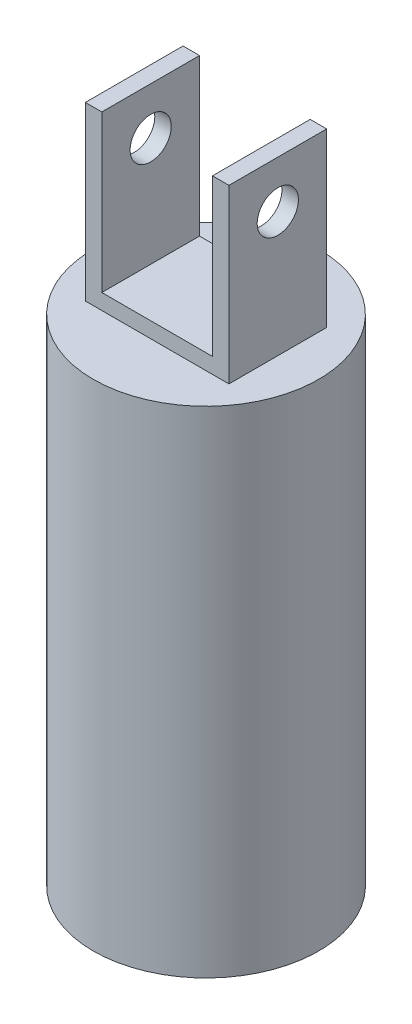
ISO-10303-21;
HEADER;
FILE_DESCRIPTION(('STEP AP214'),'2;1');
FILE_NAME('part.step','',(''),(''),'','','');
FILE_SCHEMA(('AUTOMOTIVE_DESIGN { 1 0 10303 214 1 1 1 1 }'));
ENDSEC;
DATA;
#1=APPLICATION_CONTEXT('core data for automotive mechanical design processes');
#2=APPLICATION_PROTOCOL_DEFINITION('international standard','automotive_design',2000,#1);
#3=PRODUCT_CONTEXT('',#1,'mechanical');
#4=PRODUCT('Part','Part','',(#3));
#5=PRODUCT_RELATED_PRODUCT_CATEGORY('part','',(#4));
#6=PRODUCT_DEFINITION_FORMATION('','',#4);
#7=PRODUCT_DEFINITION_CONTEXT('part definition',#1,'design');
#8=PRODUCT_DEFINITION('design','',#6,#7);
#9=PRODUCT_DEFINITION_SHAPE('','',#8);
#10=(LENGTH_UNIT() NAMED_UNIT(*) SI_UNIT(.MILLI.,.METRE.));
#11=(NAMED_UNIT(*) PLANE_ANGLE_UNIT() SI_UNIT($,.RADIAN.));
#12=(NAMED_UNIT(*) SI_UNIT($,.STERADIAN.) SOLID_ANGLE_UNIT());
#13=UNCERTAINTY_MEASURE_WITH_UNIT(LENGTH_MEASURE(1.E-05),#10,'distance_accuracy_value','');
#14=(GEOMETRIC_REPRESENTATION_CONTEXT(3) GLOBAL_UNCERTAINTY_ASSIGNED_CONTEXT((#13)) GLOBAL_UNIT_ASSIGNED_CONTEXT((#10,
#11,#12)) REPRESENTATION_CONTEXT('',''));
#15=CARTESIAN_POINT('',(0.,0.,0.));
#16=DIRECTION('',(0.,0.,1.));
#17=DIRECTION('',(1.,0.,0.));
#18=AXIS2_PLACEMENT_3D('',#15,#16,#17);
#19=CARTESIAN_POINT('',(0.,50.3809,28.6258));
#20=DIRECTION('',(0.,1.,0.));
#21=DIRECTION('',(0.,0.,1.));
#22=AXIS2_PLACEMENT_3D('',#19,#20,#21);
#23=PLANE('',#22);
#24=DIRECTION('',(1.,0.,0.));
#25=VECTOR('',#24,1.);
#26=CARTESIAN_POINT('',(0.,50.3809,0.));
#27=LINE('',#26,#25);
#28=CARTESIAN_POINT('',(37.2364,50.3809,0.));
#29=VERTEX_POINT('',#28);
#30=CARTESIAN_POINT('',(42.0624,50.3809,0.));
#31=VERTEX_POINT('',#30);
#32=EDGE_CURVE('E137',#29,#31,#27,.T.);
#33=ORIENTED_EDGE('',*,*,#32,.F.);
#34=DIRECTION('',(0.,0.,-1.));
#35=VECTOR('',#34,1.);
#36=CARTESIAN_POINT('',(37.2364,50.3809,28.6258));
#37=LINE('',#36,#35);
#38=CARTESIAN_POINT('',(37.2364,50.3809,28.6258));
#39=VERTEX_POINT('',#38);
#40=EDGE_CURVE('E12',#39,#29,#37,.T.);
#41=ORIENTED_EDGE('',*,*,#40,.F.);
#42=DIRECTION('',(1.,0.,0.));
#43=VECTOR('',#42,1.);
#44=CARTESIAN_POINT('',(0.,50.3809,28.6258));
#45=LINE('',#44,#43);
#46=CARTESIAN_POINT('',(42.0624,50.3809,28.6258));
#47=VERTEX_POINT('',#46);
#48=EDGE_CURVE('E158',#39,#47,#45,.T.);
#49=ORIENTED_EDGE('',*,*,#48,.T.);
#50=DIRECTION('',(0.,0.,-1.));
#51=VECTOR('',#50,1.);
#52=CARTESIAN_POINT('',(42.0624,50.3809,28.6258));
#53=LINE('',#52,#51);
#54=EDGE_CURVE('E94',#47,#31,#53,.T.);
#55=ORIENTED_EDGE('',*,*,#54,.T.);
#56=EDGE_LOOP('',(#33,#41,#49,#55));
#57=FACE_BOUND('',#56,.T.);
#58=ADVANCED_FACE('F44',(#57),#23,.T.);
#59=CARTESIAN_POINT('',(37.2364,0.,28.6258));
#60=DIRECTION('',(-1.,0.,0.));
#61=DIRECTION('',(0.,0.,1.));
#62=AXIS2_PLACEMENT_3D('',#59,#60,#61);
#63=PLANE('',#62);
#64=CARTESIAN_POINT('',(37.2364,36.576,14.3129));
#65=DIRECTION('',(-1.,0.,0.));
#66=DIRECTION('',(0.,0.,1.));
#67=AXIS2_PLACEMENT_3D('',#64,#65,#66);
#68=CIRCLE('',#67,6.0325);
#69=CARTESIAN_POINT('',(37.2364,36.576,20.3454));
#70=VERTEX_POINT('',#69);
#71=EDGE_CURVE('E199',#70,#70,#68,.T.);
#72=ORIENTED_EDGE('',*,*,#71,.F.);
#73=EDGE_LOOP('',(#72));
#74=FACE_BOUND('',#73,.T.);
#75=DIRECTION('',(0.,1.,0.));
#76=VECTOR('',#75,1.);
#77=CARTESIAN_POINT('',(37.2364,0.,0.));
#78=LINE('',#77,#76);
#79=CARTESIAN_POINT('',(37.2364,4.572,0.));
#80=VERTEX_POINT('',#79);
#81=EDGE_CURVE('E140',#80,#29,#78,.T.);
#82=ORIENTED_EDGE('',*,*,#81,.F.);
#83=DIRECTION('',(0.,0.,-1.));
#84=VECTOR('',#83,1.);
#85=CARTESIAN_POINT('',(37.2364,4.572,28.6258));
#86=LINE('',#85,#84);
#87=CARTESIAN_POINT('',(37.2364,4.572,28.6258));
#88=VERTEX_POINT('',#87);
#89=EDGE_CURVE('E52',#88,#80,#86,.T.);
#90=ORIENTED_EDGE('',*,*,#89,.F.);
#91=DIRECTION('',(0.,1.,0.));
#92=VECTOR('',#91,1.);
#93=CARTESIAN_POINT('',(37.2364,0.,28.6258));
#94=LINE('',#93,#92);
#95=EDGE_CURVE('E184',#88,#39,#94,.T.);
#96=ORIENTED_EDGE('',*,*,#95,.T.);
#97=ORIENTED_EDGE('',*,*,#40,.T.);
#98=EDGE_LOOP('',(#82,#90,#96,#97));
#99=FACE_BOUND('',#98,.T.);
#100=ADVANCED_FACE('F175',(#74,#99),#63,.T.);
#101=CARTESIAN_POINT('',(0.,4.572,28.6258));
#102=DIRECTION('',(0.,1.,0.));
#103=DIRECTION('',(0.,0.,1.));
#104=AXIS2_PLACEMENT_3D('',#101,#102,#103);
#105=PLANE('',#104);
#106=DIRECTION('',(1.,0.,0.));
#107=VECTOR('',#106,1.);
#108=CARTESIAN_POINT('',(0.,4.572,0.));
#109=LINE('',#108,#107);
#110=CARTESIAN_POINT('',(4.826,4.572,0.));
#111=VERTEX_POINT('',#110);
#112=EDGE_CURVE('E144',#111,#80,#109,.T.);
#113=ORIENTED_EDGE('',*,*,#112,.F.);
#114=DIRECTION('',(0.,0.,-1.));
#115=VECTOR('',#114,1.);
#116=CARTESIAN_POINT('',(4.826,4.572,28.6258));
#117=LINE('',#116,#115);
#118=CARTESIAN_POINT('',(4.826,4.572,28.6258));
#119=VERTEX_POINT('',#118);
#120=EDGE_CURVE('E164',#119,#111,#117,.T.);
#121=ORIENTED_EDGE('',*,*,#120,.F.);
#122=DIRECTION('',(1.,0.,0.));
#123=VECTOR('',#122,1.);
#124=CARTESIAN_POINT('',(0.,4.572,28.6258));
#125=LINE('',#124,#123);
#126=EDGE_CURVE('E171',#119,#88,#125,.T.);
#127=ORIENTED_EDGE('',*,*,#126,.T.);
#128=ORIENTED_EDGE('',*,*,#89,.T.);
#129=EDGE_LOOP('',(#113,#121,#127,#128));
#130=FACE_BOUND('',#129,.T.);
#131=ADVANCED_FACE('F169',(#130),#105,.T.);
#132=CARTESIAN_POINT('',(4.826,0.,28.6258));
#133=DIRECTION('',(1.,0.,0.));
#134=DIRECTION('',(0.,0.,-1.));
#135=AXIS2_PLACEMENT_3D('',#132,#133,#134);
#136=PLANE('',#135);
#137=CARTESIAN_POINT('',(4.826,36.576,14.3129));
#138=DIRECTION('',(1.,0.,0.));
#139=DIRECTION('',(0.,0.,-1.));
#140=AXIS2_PLACEMENT_3D('',#137,#138,#139);
#141=CIRCLE('',#140,6.0325);
#142=CARTESIAN_POINT('',(4.826,36.576,8.2804));
#143=VERTEX_POINT('',#142);
#144=EDGE_CURVE('E202',#143,#143,#141,.T.);
#145=ORIENTED_EDGE('',*,*,#144,.F.);
#146=EDGE_LOOP('',(#145));
#147=FACE_BOUND('',#146,.T.);
#148=DIRECTION('',(0.,-1.,0.));
#149=VECTOR('',#148,1.);
#150=CARTESIAN_POINT('',(4.826,0.,0.));
#151=LINE('',#150,#149);
#152=CARTESIAN_POINT('',(4.826,50.3809,0.));
#153=VERTEX_POINT('',#152);
#154=EDGE_CURVE('E147',#153,#111,#151,.T.);
#155=ORIENTED_EDGE('',*,*,#154,.F.);
#156=DIRECTION('',(0.,0.,-1.));
#157=VECTOR('',#156,1.);
#158=CARTESIAN_POINT('',(4.826,50.3809,28.6258));
#159=LINE('',#158,#157);
#160=CARTESIAN_POINT('',(4.826,50.3809,28.6258));
#161=VERTEX_POINT('',#160);
#162=EDGE_CURVE('E162',#161,#153,#159,.T.);
#163=ORIENTED_EDGE('',*,*,#162,.F.);
#164=DIRECTION('',(0.,-1.,0.));
#165=VECTOR('',#164,1.);
#166=CARTESIAN_POINT('',(4.826,0.,28.6258));
#167=LINE('',#166,#165);
#168=EDGE_CURVE('E183',#161,#119,#167,.T.);
#169=ORIENTED_EDGE('',*,*,#168,.T.);
#170=ORIENTED_EDGE('',*,*,#120,.T.);
#171=EDGE_LOOP('',(#155,#163,#169,#170));
#172=FACE_BOUND('',#171,.T.);
#173=ADVANCED_FACE('F181',(#147,#172),#136,.T.);
#174=CARTESIAN_POINT('',(0.,50.3809,28.6258));
#175=DIRECTION('',(0.,1.,0.));
#176=DIRECTION('',(0.,0.,1.));
#177=AXIS2_PLACEMENT_3D('',#174,#175,#176);
#178=PLANE('',#177);
#179=DIRECTION('',(1.,0.,0.));
#180=VECTOR('',#179,1.);
#181=CARTESIAN_POINT('',(0.,50.3809,0.));
#182=LINE('',#181,#180);
#183=CARTESIAN_POINT('',(0.,50.3809,0.));
#184=VERTEX_POINT('',#183);
#185=EDGE_CURVE('E150',#184,#153,#182,.T.);
#186=ORIENTED_EDGE('',*,*,#185,.F.);
#187=DIRECTION('',(0.,0.,-1.));
#188=VECTOR('',#187,1.);
#189=CARTESIAN_POINT('',(0.,50.3809,28.6258));
#190=LINE('',#189,#188);
#191=CARTESIAN_POINT('',(0.,50.3809,28.6258));
#192=VERTEX_POINT('',#191);
#193=EDGE_CURVE('E122',#192,#184,#190,.T.);
#194=ORIENTED_EDGE('',*,*,#193,.F.);
#195=DIRECTION('',(1.,0.,0.));
#196=VECTOR('',#195,1.);
#197=CARTESIAN_POINT('',(0.,50.3809,28.6258));
#198=LINE('',#197,#196);
#199=EDGE_CURVE('E129',#192,#161,#198,.T.);
#200=ORIENTED_EDGE('',*,*,#199,.T.);
#201=ORIENTED_EDGE('',*,*,#162,.T.);
#202=EDGE_LOOP('',(#186,#194,#200,#201));
#203=FACE_BOUND('',#202,.T.);
#204=ADVANCED_FACE('F190',(#203),#178,.T.);
#205=CARTESIAN_POINT('',(0.,0.,28.6258));
#206=DIRECTION('',(-1.,0.,0.));
#207=DIRECTION('',(0.,0.,1.));
#208=AXIS2_PLACEMENT_3D('',#205,#206,#207);
#209=PLANE('',#208);
#210=CARTESIAN_POINT('',(0.,36.576,14.3129));
#211=DIRECTION('',(-1.,0.,0.));
#212=DIRECTION('',(0.,0.,1.));
#213=AXIS2_PLACEMENT_3D('',#210,#211,#212);
#214=CIRCLE('',#213,6.0325);
#215=CARTESIAN_POINT('',(0.,36.576,20.3454));
#216=VERTEX_POINT('',#215);
#217=EDGE_CURVE('E205',#216,#216,#214,.T.);
#218=ORIENTED_EDGE('',*,*,#217,.F.);
#219=EDGE_LOOP('',(#218));
#220=FACE_BOUND('',#219,.T.);
#221=DIRECTION('',(0.,1.,0.));
#222=VECTOR('',#221,1.);
#223=CARTESIAN_POINT('',(0.,0.,0.));
#224=LINE('',#223,#222);
#225=CARTESIAN_POINT('',(0.,0.,0.));
#226=VERTEX_POINT('',#225);
#227=EDGE_CURVE('E118',#226,#184,#224,.T.);
#228=ORIENTED_EDGE('',*,*,#227,.F.);
#229=DIRECTION('',(0.,0.,-1.));
#230=VECTOR('',#229,1.);
#231=CARTESIAN_POINT('',(0.,0.,28.6258));
#232=LINE('',#231,#230);
#233=CARTESIAN_POINT('',(0.,0.,28.6258));
#234=VERTEX_POINT('',#233);
#235=EDGE_CURVE('E113',#234,#226,#232,.T.);
#236=ORIENTED_EDGE('',*,*,#235,.F.);
#237=DIRECTION('',(0.,1.,0.));
#238=VECTOR('',#237,1.);
#239=CARTESIAN_POINT('',(0.,0.,28.6258));
#240=LINE('',#239,#238);
#241=EDGE_CURVE('E116',#234,#192,#240,.T.);
#242=ORIENTED_EDGE('',*,*,#241,.T.);
#243=ORIENTED_EDGE('',*,*,#193,.T.);
#244=EDGE_LOOP('',(#228,#236,#242,#243));
#245=FACE_BOUND('',#244,.T.);
#246=ADVANCED_FACE('F115',(#220,#245),#209,.T.);
#247=CARTESIAN_POINT('',(42.0624,0.,28.6258));
#248=DIRECTION('',(-1.,0.,0.));
#249=DIRECTION('',(0.,0.,1.));
#250=AXIS2_PLACEMENT_3D('',#247,#248,#249);
#251=PLANE('',#250);
#252=CARTESIAN_POINT('',(42.0624,36.576,14.3129));
#253=DIRECTION('',(1.,0.,0.));
#254=DIRECTION('',(0.,0.,-1.));
#255=AXIS2_PLACEMENT_3D('',#252,#253,#254);
#256=CIRCLE('',#255,6.0325);
#257=CARTESIAN_POINT('',(42.0624,36.576,8.2804));
#258=VERTEX_POINT('',#257);
#259=EDGE_CURVE('E208',#258,#258,#256,.T.);
#260=ORIENTED_EDGE('',*,*,#259,.F.);
#261=EDGE_LOOP('',(#260));
#262=FACE_BOUND('',#261,.T.);
#263=DIRECTION('',(0.,1.,0.));
#264=VECTOR('',#263,1.);
#265=CARTESIAN_POINT('',(42.0624,0.,0.));
#266=LINE('',#265,#264);
#267=CARTESIAN_POINT('',(42.0624,0.,0.));
#268=VERTEX_POINT('',#267);
#269=EDGE_CURVE('E156',#268,#31,#266,.T.);
#270=ORIENTED_EDGE('',*,*,#269,.T.);
#271=ORIENTED_EDGE('',*,*,#54,.F.);
#272=DIRECTION('',(0.,1.,0.));
#273=VECTOR('',#272,1.);
#274=CARTESIAN_POINT('',(42.0624,0.,28.6258));
#275=LINE('',#274,#273);
#276=CARTESIAN_POINT('',(42.0624,0.,28.6258));
#277=VERTEX_POINT('',#276);
#278=EDGE_CURVE('E60',#277,#47,#275,.T.);
#279=ORIENTED_EDGE('',*,*,#278,.F.);
#280=DIRECTION('',(0.,0.,-1.));
#281=VECTOR('',#280,1.);
#282=CARTESIAN_POINT('',(42.0624,0.,28.6258));
#283=LINE('',#282,#281);
#284=EDGE_CURVE('E87',#277,#268,#283,.T.);
#285=ORIENTED_EDGE('',*,*,#284,.T.);
#286=EDGE_LOOP('',(#270,#271,#279,#285));
#287=FACE_BOUND('',#286,.T.);
#288=ADVANCED_FACE('F192',(#262,#287),#251,.F.);
#289=CARTESIAN_POINT('',(0.,0.,28.6258));
#290=DIRECTION('',(0.,0.,1.));
#291=DIRECTION('',(1.,0.,0.));
#292=AXIS2_PLACEMENT_3D('',#289,#290,#291);
#293=PLANE('',#292);
#294=ORIENTED_EDGE('',*,*,#48,.F.);
#295=ORIENTED_EDGE('',*,*,#95,.F.);
#296=ORIENTED_EDGE('',*,*,#126,.F.);
#297=ORIENTED_EDGE('',*,*,#168,.F.);
#298=ORIENTED_EDGE('',*,*,#199,.F.);
#299=ORIENTED_EDGE('',*,*,#241,.F.);
#300=DIRECTION('',(1.,0.,0.));
#301=VECTOR('',#300,1.);
#302=CARTESIAN_POINT('',(0.,0.,28.6258));
#303=LINE('',#302,#301);
#304=EDGE_CURVE('E126',#234,#277,#303,.T.);
#305=ORIENTED_EDGE('',*,*,#304,.T.);
#306=ORIENTED_EDGE('',*,*,#278,.T.);
#307=EDGE_LOOP('',(#294,#295,#296,#297,#298,#299,#305,#306));
#308=FACE_BOUND('',#307,.T.);
#309=ADVANCED_FACE('F125',(#308),#293,.T.);
#310=CARTESIAN_POINT('',(0.,0.,0.));
#311=DIRECTION('',(0.,0.,1.));
#312=DIRECTION('',(1.,0.,0.));
#313=AXIS2_PLACEMENT_3D('',#310,#311,#312);
#314=PLANE('',#313);
#315=ORIENTED_EDGE('',*,*,#32,.T.);
#316=ORIENTED_EDGE('',*,*,#269,.F.);
#317=DIRECTION('',(1.,0.,0.));
#318=VECTOR('',#317,1.);
#319=CARTESIAN_POINT('',(0.,0.,0.));
#320=LINE('',#319,#318);
#321=EDGE_CURVE('E154',#226,#268,#320,.T.);
#322=ORIENTED_EDGE('',*,*,#321,.F.);
#323=ORIENTED_EDGE('',*,*,#227,.T.);
#324=ORIENTED_EDGE('',*,*,#185,.T.);
#325=ORIENTED_EDGE('',*,*,#154,.T.);
#326=ORIENTED_EDGE('',*,*,#112,.T.);
#327=ORIENTED_EDGE('',*,*,#81,.T.);
#328=EDGE_LOOP('',(#315,#316,#322,#323,#324,#325,#326,#327));
#329=FACE_BOUND('',#328,.T.);
#330=ADVANCED_FACE('F177',(#329),#314,.F.);
#331=CARTESIAN_POINT('',(21.0312,0.,14.3129));
#332=DIRECTION('',(0.,-1.,0.));
#333=DIRECTION('',(0.,0.,-1.));
#334=AXIS2_PLACEMENT_3D('',#331,#332,#333);
#335=PLANE('',#334);
#336=ORIENTED_EDGE('',*,*,#321,.T.);
#337=ORIENTED_EDGE('',*,*,#284,.F.);
#338=ORIENTED_EDGE('',*,*,#304,.F.);
#339=ORIENTED_EDGE('',*,*,#235,.T.);
#340=EDGE_LOOP('',(#336,#337,#338,#339));
#341=FACE_BOUND('',#340,.T.);
#342=CARTESIAN_POINT('',(21.0312,0.,14.3129));
#343=DIRECTION('',(0.,1.,0.));
#344=DIRECTION('',(0.,0.,1.));
#345=AXIS2_PLACEMENT_3D('',#342,#343,#344);
#346=CIRCLE('',#345,33.02);
#347=CARTESIAN_POINT('',(21.0312,0.,47.3329));
#348=VERTEX_POINT('',#347);
#349=EDGE_CURVE('E196',#348,#348,#346,.T.);
#350=ORIENTED_EDGE('',*,*,#349,.T.);
#351=EDGE_LOOP('',(#350));
#352=FACE_BOUND('',#351,.T.);
#353=ADVANCED_FACE('F131',(#341,#352),#335,.F.);
#354=CARTESIAN_POINT('',(21.0312,-238.428663659119,14.3129));
#355=DIRECTION('',(0.,1.,0.));
#356=DIRECTION('',(0.,0.,1.));
#357=AXIS2_PLACEMENT_3D('',#354,#355,#356);
#358=CYLINDRICAL_SURFACE('',#357,33.02);
#359=ORIENTED_EDGE('',*,*,#349,.F.);
#360=EDGE_LOOP('',(#359));
#361=FACE_BOUND('',#360,.T.);
#362=CARTESIAN_POINT('',(21.0312,-145.034,14.3129));
#363=DIRECTION('',(0.,-1.,0.));
#364=DIRECTION('',(0.,0.,-1.));
#365=AXIS2_PLACEMENT_3D('',#362,#363,#364);
#366=CIRCLE('',#365,33.02);
#367=CARTESIAN_POINT('',(21.0312,-145.034,-18.7071));
#368=VERTEX_POINT('',#367);
#369=EDGE_CURVE('E141',#368,#368,#366,.F.);
#370=ORIENTED_EDGE('',*,*,#369,.T.);
#371=EDGE_LOOP('',(#370));
#372=FACE_BOUND('',#371,.T.);
#373=ADVANCED_FACE('F231',(#361,#372),#358,.T.);
#374=CARTESIAN_POINT('',(21.0312,-145.034,14.3129));
#375=DIRECTION('',(0.,-1.,0.));
#376=DIRECTION('',(0.,0.,-1.));
#377=AXIS2_PLACEMENT_3D('',#374,#375,#376);
#378=PLANE('',#377);
#379=CARTESIAN_POINT('',(21.0312,-145.034,14.3129));
#380=DIRECTION('',(0.,-1.,0.));
#381=DIRECTION('',(0.,0.,-1.));
#382=AXIS2_PLACEMENT_3D('',#379,#380,#381);
#383=CIRCLE('',#382,19.812);
#384=CARTESIAN_POINT('',(21.0312,-145.034,-5.4991));
#385=VERTEX_POINT('',#384);
#386=EDGE_CURVE('E212',#385,#385,#383,.T.);
#387=ORIENTED_EDGE('',*,*,#386,.F.);
#388=EDGE_LOOP('',(#387));
#389=FACE_BOUND('',#388,.T.);
#390=ORIENTED_EDGE('',*,*,#369,.F.);
#391=EDGE_LOOP('',(#390));
#392=FACE_BOUND('',#391,.T.);
#393=ADVANCED_FACE('F227',(#389,#392),#378,.T.);
#394=CARTESIAN_POINT('',(-11.9888,36.576,14.3129));
#395=DIRECTION('',(1.,0.,0.));
#396=DIRECTION('',(0.,0.,-1.));
#397=AXIS2_PLACEMENT_3D('',#394,#395,#396);
#398=CYLINDRICAL_SURFACE('',#397,6.0325);
#399=ORIENTED_EDGE('',*,*,#71,.T.);
#400=EDGE_LOOP('',(#399));
#401=FACE_BOUND('',#400,.T.);
#402=ORIENTED_EDGE('',*,*,#259,.T.);
#403=EDGE_LOOP('',(#402));
#404=FACE_BOUND('',#403,.T.);
#405=ADVANCED_FACE('F230',(#401,#404),#398,.F.);
#406=ORIENTED_EDGE('',*,*,#144,.T.);
#407=EDGE_LOOP('',(#406));
#408=FACE_BOUND('',#407,.T.);
#409=ORIENTED_EDGE('',*,*,#217,.T.);
#410=EDGE_LOOP('',(#409));
#411=FACE_BOUND('',#410,.T.);
#412=ADVANCED_FACE('F223',(#408,#411),#398,.F.);
#413=CARTESIAN_POINT('',(21.0312,-38.1,14.3129));
#414=DIRECTION('',(0.,-1.,0.));
#415=DIRECTION('',(0.,0.,-1.));
#416=AXIS2_PLACEMENT_3D('',#413,#414,#415);
#417=CYLINDRICAL_SURFACE('',#416,19.812);
#418=CARTESIAN_POINT('',(21.0312,-38.1,14.3129));
#419=DIRECTION('',(0.,-1.,0.));
#420=DIRECTION('',(0.,0.,-1.));
#421=AXIS2_PLACEMENT_3D('',#418,#419,#420);
#422=CIRCLE('',#421,19.812);
#423=CARTESIAN_POINT('',(21.0312,-38.1,-5.4991));
#424=VERTEX_POINT('',#423);
#425=EDGE_CURVE('E211',#424,#424,#422,.T.);
#426=ORIENTED_EDGE('',*,*,#425,.F.);
#427=EDGE_LOOP('',(#426));
#428=FACE_BOUND('',#427,.T.);
#429=ORIENTED_EDGE('',*,*,#386,.T.);
#430=EDGE_LOOP('',(#429));
#431=FACE_BOUND('',#430,.T.);
#432=ADVANCED_FACE('F220',(#428,#431),#417,.F.);
#433=CARTESIAN_POINT('',(21.0312,-38.1,14.3129));
#434=DIRECTION('',(0.,-1.,0.));
#435=DIRECTION('',(0.,0.,-1.));
#436=AXIS2_PLACEMENT_3D('',#433,#434,#435);
#437=PLANE('',#436);
#438=ORIENTED_EDGE('',*,*,#425,.T.);
#439=EDGE_LOOP('',(#438));
#440=FACE_BOUND('',#439,.T.);
#441=ADVANCED_FACE('F218',(#440),#437,.T.);
#442=CLOSED_SHELL('',(#58,#100,#131,#173,#204,#246,#288,#309,#330,#353,#373,#393,#405,#412,#432,#441));
#443=MANIFOLD_SOLID_BREP('B2',#442);
#444=ADVANCED_BREP_SHAPE_REPRESENTATION('',(#18,#443),#14);
#445=SHAPE_DEFINITION_REPRESENTATION(#9,#444);
ENDSEC;
END-ISO-10303-21;
